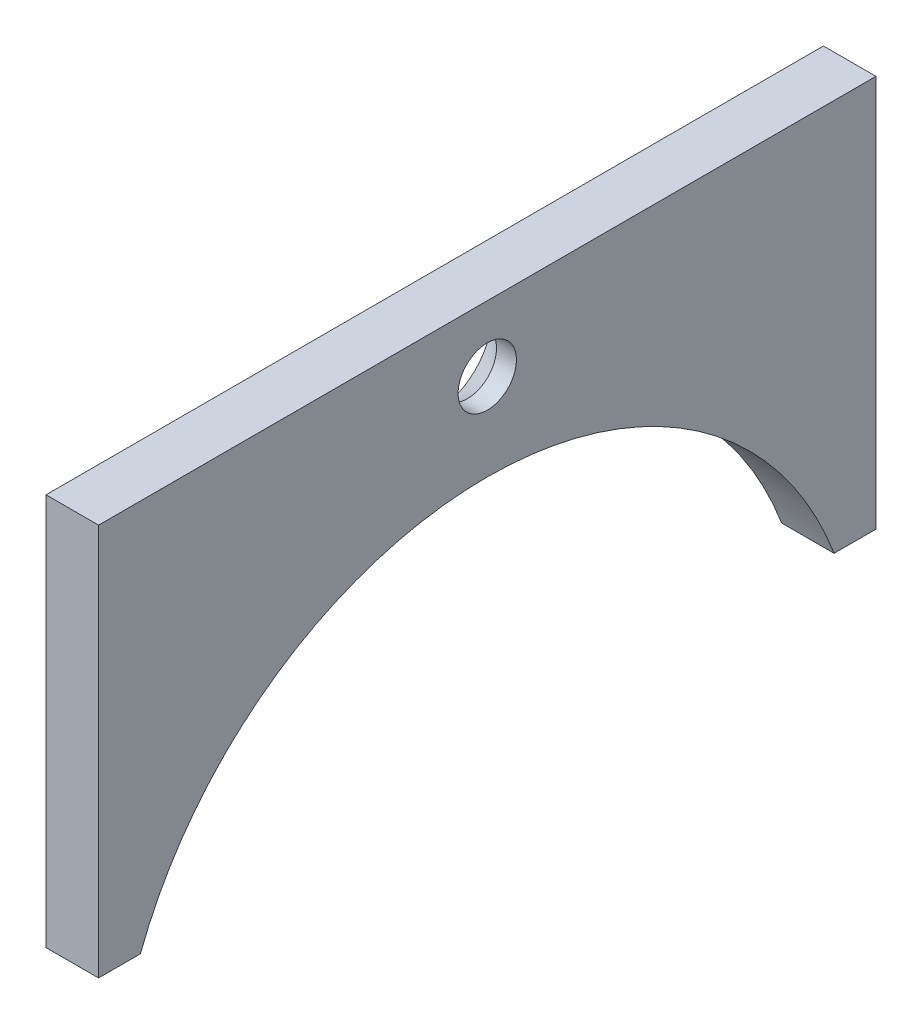
ISO-10303-21;
HEADER;
FILE_DESCRIPTION(('STEP AP214'),'2;1');
FILE_NAME('part.step','',(''),(''),'','','');
FILE_SCHEMA(('AUTOMOTIVE_DESIGN { 1 0 10303 214 1 1 1 1 }'));
ENDSEC;
DATA;
#1=APPLICATION_CONTEXT('core data for automotive mechanical design processes');
#2=APPLICATION_PROTOCOL_DEFINITION('international standard','automotive_design',2000,#1);
#3=PRODUCT_CONTEXT('',#1,'mechanical');
#4=PRODUCT('Part','Part','',(#3));
#5=PRODUCT_RELATED_PRODUCT_CATEGORY('part','',(#4));
#6=PRODUCT_DEFINITION_FORMATION('','',#4);
#7=PRODUCT_DEFINITION_CONTEXT('part definition',#1,'design');
#8=PRODUCT_DEFINITION('design','',#6,#7);
#9=PRODUCT_DEFINITION_SHAPE('','',#8);
#10=(LENGTH_UNIT() NAMED_UNIT(*) SI_UNIT(.MILLI.,.METRE.));
#11=(NAMED_UNIT(*) PLANE_ANGLE_UNIT() SI_UNIT($,.RADIAN.));
#12=(NAMED_UNIT(*) SI_UNIT($,.STERADIAN.) SOLID_ANGLE_UNIT());
#13=UNCERTAINTY_MEASURE_WITH_UNIT(LENGTH_MEASURE(1.E-05),#10,'distance_accuracy_value','');
#14=(GEOMETRIC_REPRESENTATION_CONTEXT(3) GLOBAL_UNCERTAINTY_ASSIGNED_CONTEXT((#13)) GLOBAL_UNIT_ASSIGNED_CONTEXT((#10,
#11,#12)) REPRESENTATION_CONTEXT('',''));
#15=CARTESIAN_POINT('',(0.,0.,0.));
#16=DIRECTION('',(0.,0.,1.));
#17=DIRECTION('',(1.,0.,0.));
#18=AXIS2_PLACEMENT_3D('',#15,#16,#17);
#19=CARTESIAN_POINT('',(-3.3502,4.,35.7421022839422));
#20=DIRECTION('',(0.,1.,0.));
#21=DIRECTION('',(0.,0.,1.));
#22=AXIS2_PLACEMENT_3D('',#19,#20,#21);
#23=PLANE('',#22);
#24=DIRECTION('',(0.,0.,-1.));
#25=VECTOR('',#24,1.);
#26=CARTESIAN_POINT('',(-3.3502,4.,35.7421022839422));
#27=LINE('',#26,#25);
#28=CARTESIAN_POINT('',(-3.3502,4.,23.685438564654));
#29=VERTEX_POINT('',#28);
#30=CARTESIAN_POINT('',(-3.3502,4.,22.4110682546121));
#31=VERTEX_POINT('',#30);
#32=EDGE_CURVE('E98',#29,#31,#27,.T.);
#33=ORIENTED_EDGE('',*,*,#32,.T.);
#34=DIRECTION('',(1.,0.,0.));
#35=VECTOR('',#34,1.);
#36=CARTESIAN_POINT('',(-11.75,4.,22.4110682546121));
#37=LINE('',#36,#35);
#38=CARTESIAN_POINT('',(-1.75,4.,22.4110682546121));
#39=VERTEX_POINT('',#38);
#40=EDGE_CURVE('E86',#31,#39,#37,.T.);
#41=ORIENTED_EDGE('',*,*,#40,.T.);
#42=DIRECTION('',(0.,0.,-1.));
#43=VECTOR('',#42,1.);
#44=CARTESIAN_POINT('',(-1.75,4.,35.7421022839422));
#45=LINE('',#44,#43);
#46=CARTESIAN_POINT('',(-1.75,4.,23.685438564654));
#47=VERTEX_POINT('',#46);
#48=EDGE_CURVE('E96',#47,#39,#45,.T.);
#49=ORIENTED_EDGE('',*,*,#48,.F.);
#50=DIRECTION('',(1.,0.,0.));
#51=VECTOR('',#50,1.);
#52=CARTESIAN_POINT('',(-3.3502,4.,23.685438564654));
#53=LINE('',#52,#51);
#54=EDGE_CURVE('E113',#29,#47,#53,.T.);
#55=ORIENTED_EDGE('',*,*,#54,.F.);
#56=EDGE_LOOP('',(#33,#41,#49,#55));
#57=FACE_BOUND('',#56,.T.);
#58=ADVANCED_FACE('F33',(#57),#23,.F.);
#59=CARTESIAN_POINT('',(-3.3502,4.,35.7421022839422));
#60=DIRECTION('',(1.,0.,0.));
#61=DIRECTION('',(0.,0.,-1.));
#62=AXIS2_PLACEMENT_3D('',#59,#60,#61);
#63=PLANE('',#62);
#64=CARTESIAN_POINT('',(-3.3502,13.95,11.842719282327));
#65=DIRECTION('',(-1.,0.,0.));
#66=DIRECTION('',(0.,0.,1.));
#67=AXIS2_PLACEMENT_3D('',#64,#65,#66);
#68=CIRCLE('',#67,1.7526);
#69=CARTESIAN_POINT('',(-3.3502,13.95,13.595319282327));
#70=VERTEX_POINT('',#69);
#71=EDGE_CURVE('E230',#70,#70,#68,.T.);
#72=ORIENTED_EDGE('',*,*,#71,.F.);
#73=EDGE_LOOP('',(#72));
#74=FACE_BOUND('',#73,.T.);
#75=CARTESIAN_POINT('',(-3.3502,4.,1.27437031004189));
#76=VERTEX_POINT('',#75);
#77=CARTESIAN_POINT('',(-3.3502,4.,0.));
#78=VERTEX_POINT('',#77);
#79=EDGE_CURVE('E104',#76,#78,#27,.T.);
#80=ORIENTED_EDGE('',*,*,#79,.F.);
#81=CARTESIAN_POINT('',(-3.3502,0.,11.842719282327));
#82=DIRECTION('',(1.,0.,0.));
#83=DIRECTION('',(0.,0.,-1.));
#84=AXIS2_PLACEMENT_3D('',#81,#82,#83);
#85=CIRCLE('',#84,11.3);
#86=EDGE_CURVE('E118',#76,#31,#85,.T.);
#87=ORIENTED_EDGE('',*,*,#86,.T.);
#88=ORIENTED_EDGE('',*,*,#32,.F.);
#89=DIRECTION('',(0.,-1.,0.));
#90=VECTOR('',#89,1.);
#91=CARTESIAN_POINT('',(-3.3502,4.,23.685438564654));
#92=LINE('',#91,#90);
#93=CARTESIAN_POINT('',(-3.3502,15.95,23.685438564654));
#94=VERTEX_POINT('',#93);
#95=EDGE_CURVE('E42',#94,#29,#92,.T.);
#96=ORIENTED_EDGE('',*,*,#95,.F.);
#97=DIRECTION('',(0.,0.,-1.));
#98=VECTOR('',#97,1.);
#99=CARTESIAN_POINT('',(-3.3502,15.95,35.7421022839422));
#100=LINE('',#99,#98);
#101=CARTESIAN_POINT('',(-3.3502,15.95,0.));
#102=VERTEX_POINT('',#101);
#103=EDGE_CURVE('E133',#94,#102,#100,.T.);
#104=ORIENTED_EDGE('',*,*,#103,.T.);
#105=DIRECTION('',(0.,-1.,0.));
#106=VECTOR('',#105,1.);
#107=CARTESIAN_POINT('',(-3.3502,4.,0.));
#108=LINE('',#107,#106);
#109=EDGE_CURVE('E120',#102,#78,#108,.T.);
#110=ORIENTED_EDGE('',*,*,#109,.T.);
#111=EDGE_LOOP('',(#80,#87,#88,#96,#104,#110));
#112=FACE_BOUND('',#111,.T.);
#113=ADVANCED_FACE('F35',(#74,#112),#63,.F.);
#114=CARTESIAN_POINT('',(-1.75,4.,1.27437031004188));
#115=VERTEX_POINT('',#114);
#116=CARTESIAN_POINT('',(-1.75,4.,0.));
#117=VERTEX_POINT('',#116);
#118=EDGE_CURVE('E105',#115,#117,#45,.T.);
#119=ORIENTED_EDGE('',*,*,#118,.F.);
#120=DIRECTION('',(1.,0.,0.));
#121=VECTOR('',#120,1.);
#122=CARTESIAN_POINT('',(-11.75,4.,1.27437031004189));
#123=LINE('',#122,#121);
#124=EDGE_CURVE('E50',#76,#115,#123,.T.);
#125=ORIENTED_EDGE('',*,*,#124,.F.);
#126=ORIENTED_EDGE('',*,*,#79,.T.);
#127=DIRECTION('',(1.,0.,0.));
#128=VECTOR('',#127,1.);
#129=CARTESIAN_POINT('',(-3.3502,4.,0.));
#130=LINE('',#129,#128);
#131=EDGE_CURVE('E122',#78,#117,#130,.T.);
#132=ORIENTED_EDGE('',*,*,#131,.T.);
#133=EDGE_LOOP('',(#119,#125,#126,#132));
#134=FACE_BOUND('',#133,.T.);
#135=ADVANCED_FACE('F143',(#134),#23,.F.);
#136=CARTESIAN_POINT('',(-1.75,4.,35.7421022839422));
#137=DIRECTION('',(-1.,0.,0.));
#138=DIRECTION('',(0.,0.,1.));
#139=AXIS2_PLACEMENT_3D('',#136,#137,#138);
#140=PLANE('',#139);
#141=CARTESIAN_POINT('',(-1.75,13.95,11.842719282327));
#142=DIRECTION('',(-1.,0.,0.));
#143=DIRECTION('',(0.,0.,1.));
#144=AXIS2_PLACEMENT_3D('',#141,#142,#143);
#145=CIRCLE('',#144,0.888999999999993);
#146=CARTESIAN_POINT('',(-1.75,13.95,12.731719282327));
#147=VERTEX_POINT('',#146);
#148=EDGE_CURVE('E37',#147,#147,#145,.T.);
#149=ORIENTED_EDGE('',*,*,#148,.T.);
#150=EDGE_LOOP('',(#149));
#151=FACE_BOUND('',#150,.T.);
#152=ORIENTED_EDGE('',*,*,#48,.T.);
#153=CARTESIAN_POINT('',(-1.75,0.,11.842719282327));
#154=DIRECTION('',(1.,0.,0.));
#155=DIRECTION('',(0.,0.,-1.));
#156=AXIS2_PLACEMENT_3D('',#153,#154,#155);
#157=CIRCLE('',#156,11.3);
#158=EDGE_CURVE('E83',#115,#39,#157,.T.);
#159=ORIENTED_EDGE('',*,*,#158,.F.);
#160=ORIENTED_EDGE('',*,*,#118,.T.);
#161=DIRECTION('',(0.,1.,0.));
#162=VECTOR('',#161,1.);
#163=CARTESIAN_POINT('',(-1.75,4.,0.));
#164=LINE('',#163,#162);
#165=CARTESIAN_POINT('',(-1.75,15.95,0.));
#166=VERTEX_POINT('',#165);
#167=EDGE_CURVE('E128',#117,#166,#164,.T.);
#168=ORIENTED_EDGE('',*,*,#167,.T.);
#169=DIRECTION('',(0.,0.,-1.));
#170=VECTOR('',#169,1.);
#171=CARTESIAN_POINT('',(-1.75,15.95,35.7421022839422));
#172=LINE('',#171,#170);
#173=CARTESIAN_POINT('',(-1.75,15.95,23.685438564654));
#174=VERTEX_POINT('',#173);
#175=EDGE_CURVE('E108',#174,#166,#172,.T.);
#176=ORIENTED_EDGE('',*,*,#175,.F.);
#177=DIRECTION('',(0.,1.,0.));
#178=VECTOR('',#177,1.);
#179=CARTESIAN_POINT('',(-1.75,4.,23.685438564654));
#180=LINE('',#179,#178);
#181=EDGE_CURVE('E103',#47,#174,#180,.T.);
#182=ORIENTED_EDGE('',*,*,#181,.F.);
#183=EDGE_LOOP('',(#152,#159,#160,#168,#176,#182));
#184=FACE_BOUND('',#183,.T.);
#185=ADVANCED_FACE('F101',(#151,#184),#140,.F.);
#186=CARTESIAN_POINT('',(-3.3502,15.95,35.7421022839422));
#187=DIRECTION('',(0.,-1.,0.));
#188=DIRECTION('',(0.,0.,-1.));
#189=AXIS2_PLACEMENT_3D('',#186,#187,#188);
#190=PLANE('',#189);
#191=DIRECTION('',(-1.,0.,0.));
#192=VECTOR('',#191,1.);
#193=CARTESIAN_POINT('',(-3.3502,15.95,23.685438564654));
#194=LINE('',#193,#192);
#195=EDGE_CURVE('E11',#174,#94,#194,.T.);
#196=ORIENTED_EDGE('',*,*,#195,.F.);
#197=ORIENTED_EDGE('',*,*,#175,.T.);
#198=DIRECTION('',(-1.,0.,0.));
#199=VECTOR('',#198,1.);
#200=CARTESIAN_POINT('',(-3.3502,15.95,0.));
#201=LINE('',#200,#199);
#202=EDGE_CURVE('E131',#166,#102,#201,.T.);
#203=ORIENTED_EDGE('',*,*,#202,.T.);
#204=ORIENTED_EDGE('',*,*,#103,.F.);
#205=EDGE_LOOP('',(#196,#197,#203,#204));
#206=FACE_BOUND('',#205,.T.);
#207=ADVANCED_FACE('F135',(#206),#190,.F.);
#208=CARTESIAN_POINT('',(0.,0.,0.));
#209=DIRECTION('',(0.,0.,-1.));
#210=DIRECTION('',(-1.,0.,0.));
#211=AXIS2_PLACEMENT_3D('',#208,#209,#210);
#212=PLANE('',#211);
#213=ORIENTED_EDGE('',*,*,#109,.F.);
#214=ORIENTED_EDGE('',*,*,#202,.F.);
#215=ORIENTED_EDGE('',*,*,#167,.F.);
#216=ORIENTED_EDGE('',*,*,#131,.F.);
#217=EDGE_LOOP('',(#213,#214,#215,#216));
#218=FACE_BOUND('',#217,.T.);
#219=ADVANCED_FACE('F141',(#218),#212,.T.);
#220=CARTESIAN_POINT('',(-1.75,17.,23.685438564654));
#221=DIRECTION('',(0.,0.,1.));
#222=DIRECTION('',(1.,0.,0.));
#223=AXIS2_PLACEMENT_3D('',#220,#221,#222);
#224=PLANE('',#223);
#225=ORIENTED_EDGE('',*,*,#195,.T.);
#226=ORIENTED_EDGE('',*,*,#95,.T.);
#227=ORIENTED_EDGE('',*,*,#54,.T.);
#228=ORIENTED_EDGE('',*,*,#181,.T.);
#229=EDGE_LOOP('',(#225,#226,#227,#228));
#230=FACE_BOUND('',#229,.T.);
#231=ADVANCED_FACE('F114',(#230),#224,.T.);
#232=CARTESIAN_POINT('',(-11.75,0.,11.842719282327));
#233=DIRECTION('',(1.,0.,0.));
#234=DIRECTION('',(0.,0.,-1.));
#235=AXIS2_PLACEMENT_3D('',#232,#233,#234);
#236=CYLINDRICAL_SURFACE('',#235,11.3);
#237=ORIENTED_EDGE('',*,*,#124,.T.);
#238=ORIENTED_EDGE('',*,*,#158,.T.);
#239=ORIENTED_EDGE('',*,*,#40,.F.);
#240=ORIENTED_EDGE('',*,*,#86,.F.);
#241=EDGE_LOOP('',(#237,#238,#239,#240));
#242=FACE_BOUND('',#241,.T.);
#243=ADVANCED_FACE('F85',(#242),#236,.F.);
#244=CARTESIAN_POINT('',(-3.3502,13.95,11.842719282327));
#245=DIRECTION('',(-1.,0.,0.));
#246=DIRECTION('',(0.,0.,1.));
#247=AXIS2_PLACEMENT_3D('',#244,#245,#246);
#248=CYLINDRICAL_SURFACE('',#247,0.888999999999993);
#249=CARTESIAN_POINT('',(-2.35674184352394,13.95,11.842719282327));
#250=DIRECTION('',(-1.,0.,0.));
#251=DIRECTION('',(0.,0.,1.));
#252=AXIS2_PLACEMENT_3D('',#249,#250,#251);
#253=CIRCLE('',#252,0.888999999999999);
#254=CARTESIAN_POINT('',(-2.35674184352394,13.95,12.731719282327));
#255=VERTEX_POINT('',#254);
#256=EDGE_CURVE('E227',#255,#255,#253,.T.);
#257=ORIENTED_EDGE('',*,*,#256,.T.);
#258=EDGE_LOOP('',(#257));
#259=FACE_BOUND('',#258,.T.);
#260=ORIENTED_EDGE('',*,*,#148,.F.);
#261=EDGE_LOOP('',(#260));
#262=FACE_BOUND('',#261,.T.);
#263=ADVANCED_FACE('F178',(#259,#262),#248,.F.);
#264=CARTESIAN_POINT('',(-3.3502,13.95,11.842719282327));
#265=DIRECTION('',(-1.,0.,0.));
#266=DIRECTION('',(0.,0.,1.));
#267=AXIS2_PLACEMENT_3D('',#264,#265,#266);
#268=CONICAL_SURFACE('',#267,1.7526,0.715584993317676);
#269=ORIENTED_EDGE('',*,*,#256,.F.);
#270=EDGE_LOOP('',(#269));
#271=FACE_BOUND('',#270,.T.);
#272=ORIENTED_EDGE('',*,*,#71,.T.);
#273=EDGE_LOOP('',(#272));
#274=FACE_BOUND('',#273,.T.);
#275=ADVANCED_FACE('F183',(#271,#274),#268,.F.);
#276=CLOSED_SHELL('',(#58,#113,#135,#185,#207,#219,#231,#243,#263,#275));
#277=MANIFOLD_SOLID_BREP('B2',#276);
#278=ADVANCED_BREP_SHAPE_REPRESENTATION('',(#18,#277),#14);
#279=SHAPE_DEFINITION_REPRESENTATION(#9,#278);
ENDSEC;
END-ISO-10303-21;
